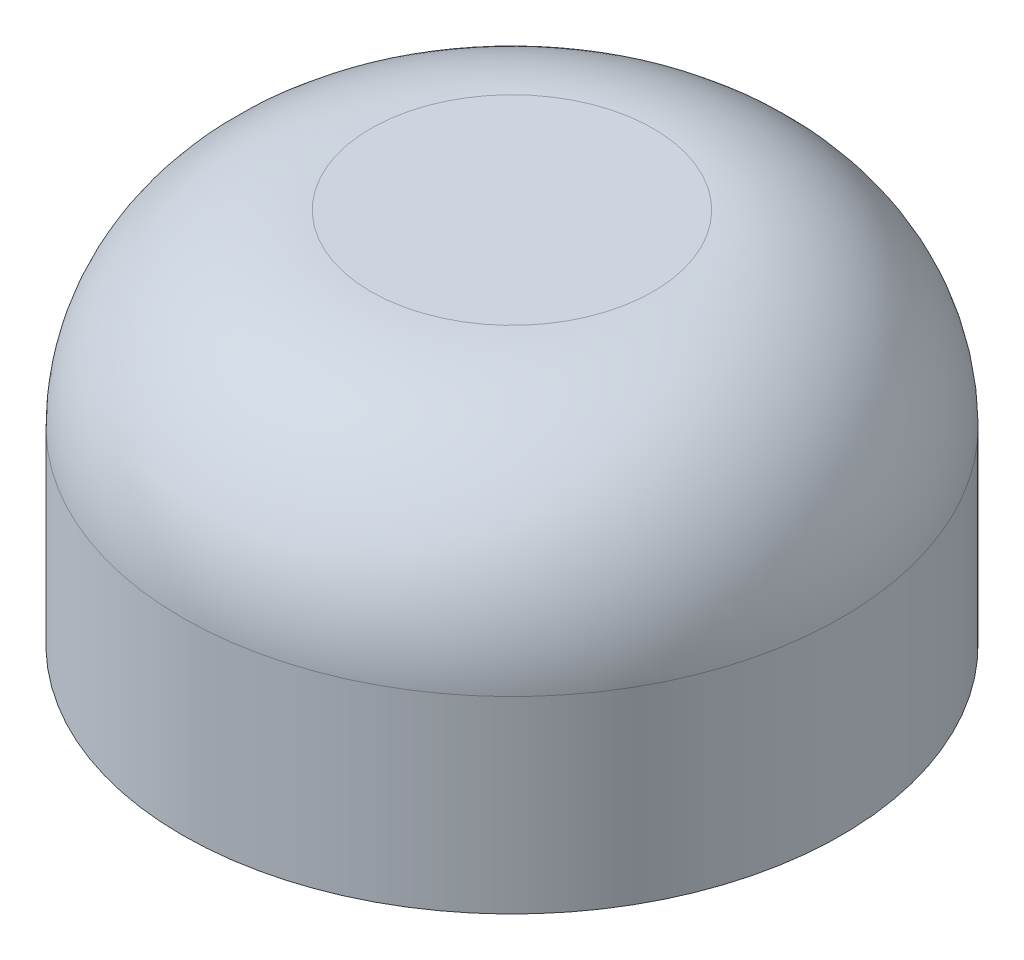
ISO-10303-21;
HEADER;
FILE_DESCRIPTION(('STEP AP214'),'2;1');
FILE_NAME('part.step','',(''),(''),'','','');
FILE_SCHEMA(('AUTOMOTIVE_DESIGN { 1 0 10303 214 1 1 1 1 }'));
ENDSEC;
DATA;
#1=APPLICATION_CONTEXT('core data for automotive mechanical design processes');
#2=APPLICATION_PROTOCOL_DEFINITION('international standard','automotive_design',2000,#1);
#3=PRODUCT_CONTEXT('',#1,'mechanical');
#4=PRODUCT('Part','Part','',(#3));
#5=PRODUCT_RELATED_PRODUCT_CATEGORY('part','',(#4));
#6=PRODUCT_DEFINITION_FORMATION('','',#4);
#7=PRODUCT_DEFINITION_CONTEXT('part definition',#1,'design');
#8=PRODUCT_DEFINITION('design','',#6,#7);
#9=PRODUCT_DEFINITION_SHAPE('','',#8);
#10=(LENGTH_UNIT() NAMED_UNIT(*) SI_UNIT(.MILLI.,.METRE.));
#11=(NAMED_UNIT(*) PLANE_ANGLE_UNIT() SI_UNIT($,.RADIAN.));
#12=(NAMED_UNIT(*) SI_UNIT($,.STERADIAN.) SOLID_ANGLE_UNIT());
#13=UNCERTAINTY_MEASURE_WITH_UNIT(LENGTH_MEASURE(1.E-05),#10,'distance_accuracy_value','');
#14=(GEOMETRIC_REPRESENTATION_CONTEXT(3) GLOBAL_UNCERTAINTY_ASSIGNED_CONTEXT((#13)) GLOBAL_UNIT_ASSIGNED_CONTEXT((#10,
#11,#12)) REPRESENTATION_CONTEXT('',''));
#15=CARTESIAN_POINT('',(0.,0.,0.));
#16=DIRECTION('',(0.,0.,1.));
#17=DIRECTION('',(1.,0.,0.));
#18=AXIS2_PLACEMENT_3D('',#15,#16,#17);
#19=CARTESIAN_POINT('',(0.,2.,0.));
#20=DIRECTION('',(0.,-1.,0.));
#21=DIRECTION('',(0.,0.,-1.));
#22=AXIS2_PLACEMENT_3D('',#19,#20,#21);
#23=CYLINDRICAL_SURFACE('',#22,1.75);
#24=CARTESIAN_POINT('',(0.,1.,0.));
#25=DIRECTION('',(0.,1.,0.));
#26=DIRECTION('',(0.,0.,1.));
#27=AXIS2_PLACEMENT_3D('',#24,#25,#26);
#28=CIRCLE('',#27,1.75);
#29=CARTESIAN_POINT('',(0.,1.,1.75));
#30=VERTEX_POINT('',#29);
#31=EDGE_CURVE('E10',#30,#30,#28,.F.);
#32=ORIENTED_EDGE('',*,*,#31,.T.);
#33=EDGE_LOOP('',(#32));
#34=FACE_BOUND('',#33,.T.);
#35=CARTESIAN_POINT('',(0.,0.,0.));
#36=DIRECTION('',(0.,1.,0.));
#37=DIRECTION('',(0.,0.,1.));
#38=AXIS2_PLACEMENT_3D('',#35,#36,#37);
#39=CIRCLE('',#38,1.75);
#40=CARTESIAN_POINT('',(0.,0.,1.75));
#41=VERTEX_POINT('',#40);
#42=EDGE_CURVE('E45',#41,#41,#39,.T.);
#43=ORIENTED_EDGE('',*,*,#42,.T.);
#44=EDGE_LOOP('',(#43));
#45=FACE_BOUND('',#44,.T.);
#46=ADVANCED_FACE('F34',(#34,#45),#23,.T.);
#47=CARTESIAN_POINT('',(0.,2.,0.));
#48=DIRECTION('',(0.,1.,0.));
#49=DIRECTION('',(0.,0.,1.));
#50=AXIS2_PLACEMENT_3D('',#47,#48,#49);
#51=PLANE('',#50);
#52=CARTESIAN_POINT('',(0.,2.,0.));
#53=DIRECTION('',(0.,1.,0.));
#54=DIRECTION('',(0.,0.,1.));
#55=AXIS2_PLACEMENT_3D('',#52,#53,#54);
#56=CIRCLE('',#55,0.75);
#57=CARTESIAN_POINT('',(0.,2.,0.75));
#58=VERTEX_POINT('',#57);
#59=EDGE_CURVE('E41',#58,#58,#56,.T.);
#60=ORIENTED_EDGE('',*,*,#59,.T.);
#61=EDGE_LOOP('',(#60));
#62=FACE_BOUND('',#61,.T.);
#63=ADVANCED_FACE('F55',(#62),#51,.T.);
#64=CARTESIAN_POINT('',(0.,0.,0.));
#65=DIRECTION('',(0.,1.,0.));
#66=DIRECTION('',(0.,0.,1.));
#67=AXIS2_PLACEMENT_3D('',#64,#65,#66);
#68=PLANE('',#67);
#69=ORIENTED_EDGE('',*,*,#42,.F.);
#70=EDGE_LOOP('',(#69));
#71=FACE_BOUND('',#70,.T.);
#72=ADVANCED_FACE('F53',(#71),#68,.F.);
#73=CARTESIAN_POINT('',(0.,1.,0.));
#74=DIRECTION('',(0.,1.,0.));
#75=DIRECTION('',(0.,0.,1.));
#76=AXIS2_PLACEMENT_3D('',#73,#74,#75);
#77=DEGENERATE_TOROIDAL_SURFACE('',#76,0.75,1.,.T.);
#78=ORIENTED_EDGE('',*,*,#31,.F.);
#79=EDGE_LOOP('',(#78));
#80=FACE_BOUND('',#79,.T.);
#81=ORIENTED_EDGE('',*,*,#59,.F.);
#82=EDGE_LOOP('',(#81));
#83=FACE_BOUND('',#82,.T.);
#84=ADVANCED_FACE('F36',(#80,#83),#77,.T.);
#85=CLOSED_SHELL('',(#46,#63,#72,#84));
#86=MANIFOLD_SOLID_BREP('B2',#85);
#87=ADVANCED_BREP_SHAPE_REPRESENTATION('',(#18,#86),#14);
#88=SHAPE_DEFINITION_REPRESENTATION(#9,#87);
ENDSEC;
END-ISO-10303-21;
